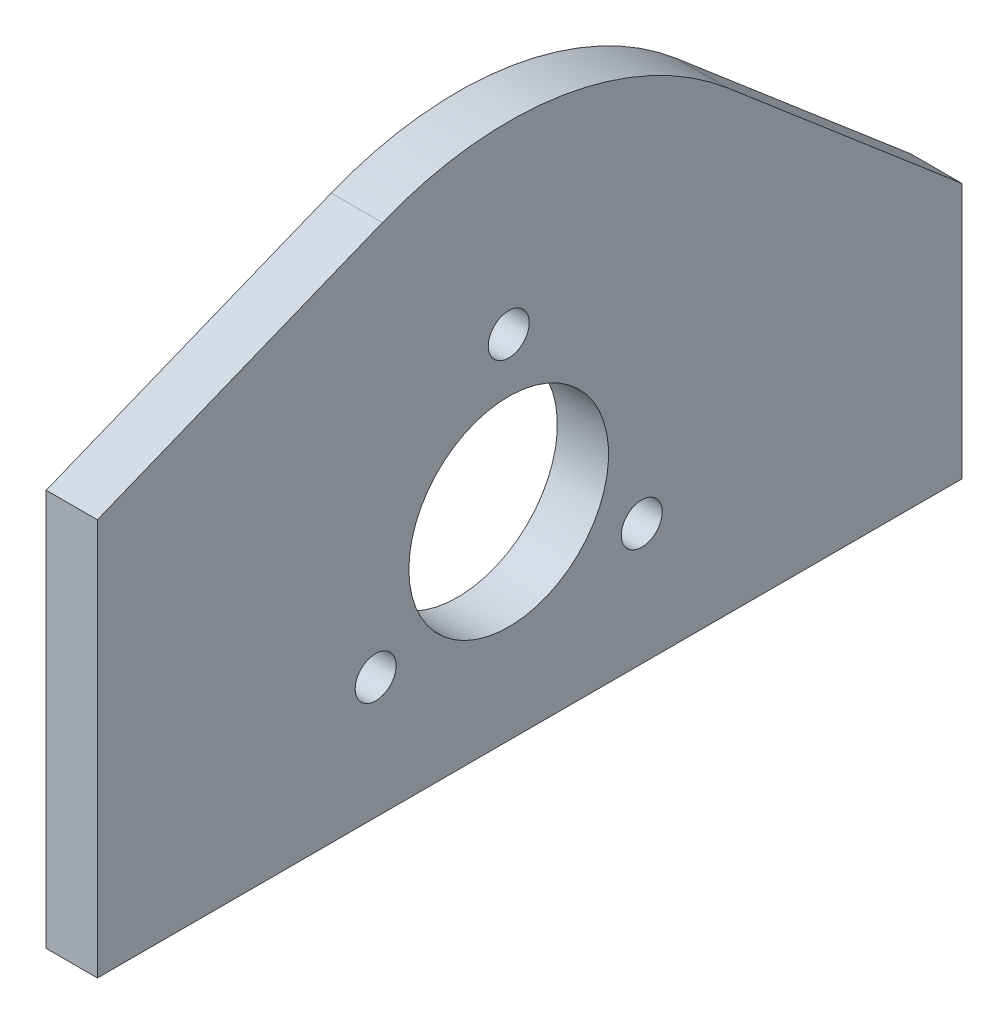
ISO-10303-21;
HEADER;
FILE_DESCRIPTION(('STEP AP214'),'2;1');
FILE_NAME('part.step','',(''),(''),'','','');
FILE_SCHEMA(('AUTOMOTIVE_DESIGN { 1 0 10303 214 1 1 1 1 }'));
ENDSEC;
DATA;
#1=APPLICATION_CONTEXT('core data for automotive mechanical design processes');
#2=APPLICATION_PROTOCOL_DEFINITION('international standard','automotive_design',2000,#1);
#3=PRODUCT_CONTEXT('',#1,'mechanical');
#4=PRODUCT('Part','Part','',(#3));
#5=PRODUCT_RELATED_PRODUCT_CATEGORY('part','',(#4));
#6=PRODUCT_DEFINITION_FORMATION('','',#4);
#7=PRODUCT_DEFINITION_CONTEXT('part definition',#1,'design');
#8=PRODUCT_DEFINITION('design','',#6,#7);
#9=PRODUCT_DEFINITION_SHAPE('','',#8);
#10=(LENGTH_UNIT() NAMED_UNIT(*) SI_UNIT(.MILLI.,.METRE.));
#11=(NAMED_UNIT(*) PLANE_ANGLE_UNIT() SI_UNIT($,.RADIAN.));
#12=(NAMED_UNIT(*) SI_UNIT($,.STERADIAN.) SOLID_ANGLE_UNIT());
#13=UNCERTAINTY_MEASURE_WITH_UNIT(LENGTH_MEASURE(1.E-05),#10,'distance_accuracy_value','');
#14=(GEOMETRIC_REPRESENTATION_CONTEXT(3) GLOBAL_UNCERTAINTY_ASSIGNED_CONTEXT((#13)) GLOBAL_UNIT_ASSIGNED_CONTEXT((#10,
#11,#12)) REPRESENTATION_CONTEXT('',''));
#15=CARTESIAN_POINT('',(0.,0.,0.));
#16=DIRECTION('',(0.,0.,1.));
#17=DIRECTION('',(1.,0.,0.));
#18=AXIS2_PLACEMENT_3D('',#15,#16,#17);
#19=CARTESIAN_POINT('',(5.,81.,0.));
#20=DIRECTION('',(-1.,0.,0.));
#21=DIRECTION('',(0.,0.,-1.));
#22=AXIS2_PLACEMENT_3D('',#19,#20,#21);
#23=CYLINDRICAL_SURFACE('',#22,33.);
#24=CARTESIAN_POINT('',(0.,81.,0.));
#25=DIRECTION('',(-1.,0.,0.));
#26=DIRECTION('',(0.,0.,1.));
#27=AXIS2_PLACEMENT_3D('',#24,#25,#26);
#28=CIRCLE('',#27,33.);
#29=CARTESIAN_POINT('',(0.,111.608123513055,12.3346169380967));
#30=VERTEX_POINT('',#29);
#31=CARTESIAN_POINT('',(0.,106.111358555441,-21.4107372946394));
#32=VERTEX_POINT('',#31);
#33=EDGE_CURVE('E122',#30,#32,#28,.T.);
#34=ORIENTED_EDGE('',*,*,#33,.F.);
#35=DIRECTION('',(-1.,0.,0.));
#36=VECTOR('',#35,1.);
#37=CARTESIAN_POINT('',(5.,111.608123513055,12.3346169380967));
#38=LINE('',#37,#36);
#39=CARTESIAN_POINT('',(5.,111.608123513055,12.3346169380967));
#40=VERTEX_POINT('',#39);
#41=EDGE_CURVE('E121',#40,#30,#38,.T.);
#42=ORIENTED_EDGE('',*,*,#41,.F.);
#43=CARTESIAN_POINT('',(5.,81.,0.));
#44=DIRECTION('',(-1.,0.,0.));
#45=DIRECTION('',(0.,0.,1.));
#46=AXIS2_PLACEMENT_3D('',#43,#44,#45);
#47=CIRCLE('',#46,33.);
#48=CARTESIAN_POINT('',(5.,106.111358555441,-21.4107372946394));
#49=VERTEX_POINT('',#48);
#50=EDGE_CURVE('E135',#40,#49,#47,.T.);
#51=ORIENTED_EDGE('',*,*,#50,.T.);
#52=DIRECTION('',(-1.,0.,0.));
#53=VECTOR('',#52,1.);
#54=CARTESIAN_POINT('',(5.,106.111358555441,-21.4107372946394));
#55=LINE('',#54,#53);
#56=EDGE_CURVE('E11',#49,#32,#55,.T.);
#57=ORIENTED_EDGE('',*,*,#56,.T.);
#58=EDGE_LOOP('',(#34,#42,#51,#57));
#59=FACE_BOUND('',#58,.T.);
#60=ADVANCED_FACE('F39',(#59),#23,.T.);
#61=CARTESIAN_POINT('',(5.,86.6470519239509,-44.2392450723134));
#62=DIRECTION('',(0.,-0.760950259255798,0.64881022104968));
#63=DIRECTION('',(0.,0.64881022104968,0.760950259255798));
#64=AXIS2_PLACEMENT_3D('',#61,#62,#63);
#65=PLANE('',#64);
#66=DIRECTION('',(0.,-0.64881022104968,-0.760950259255798));
#67=VECTOR('',#66,1.);
#68=CARTESIAN_POINT('',(0.,86.6470519239509,-44.2392450723134));
#69=LINE('',#68,#67);
#70=CARTESIAN_POINT('',(0.,86.6470519239509,-44.2392450723134));
#71=VERTEX_POINT('',#70);
#72=EDGE_CURVE('E124',#32,#71,#69,.T.);
#73=ORIENTED_EDGE('',*,*,#72,.F.);
#74=ORIENTED_EDGE('',*,*,#56,.F.);
#75=DIRECTION('',(0.,-0.64881022104968,-0.760950259255798));
#76=VECTOR('',#75,1.);
#77=CARTESIAN_POINT('',(5.,86.6470519239509,-44.2392450723134));
#78=LINE('',#77,#76);
#79=CARTESIAN_POINT('',(5.,86.6470519239509,-44.2392450723134));
#80=VERTEX_POINT('',#79);
#81=EDGE_CURVE('E87',#49,#80,#78,.T.);
#82=ORIENTED_EDGE('',*,*,#81,.T.);
#83=DIRECTION('',(-1.,0.,0.));
#84=VECTOR('',#83,1.);
#85=CARTESIAN_POINT('',(5.,86.6470519239509,-44.2392450723134));
#86=LINE('',#85,#84);
#87=EDGE_CURVE('E47',#80,#71,#86,.T.);
#88=ORIENTED_EDGE('',*,*,#87,.T.);
#89=EDGE_LOOP('',(#73,#74,#82,#88));
#90=FACE_BOUND('',#89,.T.);
#91=ADVANCED_FACE('F141',(#90),#65,.F.);
#92=CARTESIAN_POINT('',(5.,86.6470519239509,-44.2392450723134));
#93=DIRECTION('',(0.,0.,1.));
#94=DIRECTION('',(0.,1.,0.));
#95=AXIS2_PLACEMENT_3D('',#92,#93,#94);
#96=PLANE('',#95);
#97=DIRECTION('',(0.,-1.,0.));
#98=VECTOR('',#97,1.);
#99=CARTESIAN_POINT('',(0.,86.6470519239509,-44.2392450723134));
#100=LINE('',#99,#98);
#101=CARTESIAN_POINT('',(0.,61.6470519239509,-44.2392450723133));
#102=VERTEX_POINT('',#101);
#103=EDGE_CURVE('E128',#71,#102,#100,.T.);
#104=ORIENTED_EDGE('',*,*,#103,.F.);
#105=ORIENTED_EDGE('',*,*,#87,.F.);
#106=DIRECTION('',(0.,-1.,0.));
#107=VECTOR('',#106,1.);
#108=CARTESIAN_POINT('',(5.,86.6470519239509,-44.2392450723134));
#109=LINE('',#108,#107);
#110=CARTESIAN_POINT('',(5.,61.6470519239509,-44.2392450723133));
#111=VERTEX_POINT('',#110);
#112=EDGE_CURVE('E115',#80,#111,#109,.T.);
#113=ORIENTED_EDGE('',*,*,#112,.T.);
#114=DIRECTION('',(-1.,0.,0.));
#115=VECTOR('',#114,1.);
#116=CARTESIAN_POINT('',(5.,61.6470519239509,-44.2392450723133));
#117=LINE('',#116,#115);
#118=EDGE_CURVE('E109',#111,#102,#117,.T.);
#119=ORIENTED_EDGE('',*,*,#118,.T.);
#120=EDGE_LOOP('',(#104,#105,#113,#119));
#121=FACE_BOUND('',#120,.T.);
#122=ADVANCED_FACE('F208',(#121),#96,.F.);
#123=CARTESIAN_POINT('',(5.,61.6470519239509,-44.2392450723133));
#124=DIRECTION('',(0.,1.,0.));
#125=DIRECTION('',(0.,0.,-1.));
#126=AXIS2_PLACEMENT_3D('',#123,#124,#125);
#127=PLANE('',#126);
#128=DIRECTION('',(0.,0.,1.));
#129=VECTOR('',#128,1.);
#130=CARTESIAN_POINT('',(0.,61.6470519239509,-44.2392450723133));
#131=LINE('',#130,#129);
#132=CARTESIAN_POINT('',(0.,61.6470519239509,40.1601837681464));
#133=VERTEX_POINT('',#132);
#134=EDGE_CURVE('E131',#102,#133,#131,.T.);
#135=ORIENTED_EDGE('',*,*,#134,.F.);
#136=ORIENTED_EDGE('',*,*,#118,.F.);
#137=DIRECTION('',(0.,0.,1.));
#138=VECTOR('',#137,1.);
#139=CARTESIAN_POINT('',(5.,61.6470519239509,-44.2392450723133));
#140=LINE('',#139,#138);
#141=CARTESIAN_POINT('',(5.,61.6470519239509,40.1601837681464));
#142=VERTEX_POINT('',#141);
#143=EDGE_CURVE('E99',#111,#142,#140,.T.);
#144=ORIENTED_EDGE('',*,*,#143,.T.);
#145=DIRECTION('',(-1.,0.,0.));
#146=VECTOR('',#145,1.);
#147=CARTESIAN_POINT('',(5.,61.6470519239509,40.1601837681464));
#148=LINE('',#147,#146);
#149=EDGE_CURVE('E104',#142,#133,#148,.T.);
#150=ORIENTED_EDGE('',*,*,#149,.T.);
#151=EDGE_LOOP('',(#135,#136,#144,#150));
#152=FACE_BOUND('',#151,.T.);
#153=ADVANCED_FACE('F112',(#152),#127,.F.);
#154=CARTESIAN_POINT('',(5.,61.6470519239509,40.1601837681464));
#155=DIRECTION('',(0.,0.,-1.));
#156=DIRECTION('',(1.,0.,0.));
#157=AXIS2_PLACEMENT_3D('',#154,#155,#156);
#158=PLANE('',#157);
#159=DIRECTION('',(0.,1.,0.));
#160=VECTOR('',#159,1.);
#161=CARTESIAN_POINT('',(0.,61.6470519239509,40.1601837681464));
#162=LINE('',#161,#160);
#163=CARTESIAN_POINT('',(0.,100.394835387512,40.1601837681464));
#164=VERTEX_POINT('',#163);
#165=EDGE_CURVE('E106',#133,#164,#162,.T.);
#166=ORIENTED_EDGE('',*,*,#165,.F.);
#167=ORIENTED_EDGE('',*,*,#149,.F.);
#168=DIRECTION('',(0.,1.,0.));
#169=VECTOR('',#168,1.);
#170=CARTESIAN_POINT('',(5.,61.6470519239509,40.1601837681464));
#171=LINE('',#170,#169);
#172=CARTESIAN_POINT('',(5.,100.394835387512,40.1601837681464));
#173=VERTEX_POINT('',#172);
#174=EDGE_CURVE('E95',#142,#173,#171,.T.);
#175=ORIENTED_EDGE('',*,*,#174,.T.);
#176=DIRECTION('',(-1.,0.,0.));
#177=VECTOR('',#176,1.);
#178=CARTESIAN_POINT('',(5.,100.394835387512,40.1601837681464));
#179=LINE('',#178,#177);
#180=EDGE_CURVE('E110',#173,#164,#179,.T.);
#181=ORIENTED_EDGE('',*,*,#180,.T.);
#182=EDGE_LOOP('',(#166,#167,#175,#181));
#183=FACE_BOUND('',#182,.T.);
#184=ADVANCED_FACE('F105',(#183),#158,.F.);
#185=CARTESIAN_POINT('',(5.,100.394835387512,40.1601837681464));
#186=DIRECTION('',(0.,-0.927518894334992,-0.37377627085142));
#187=DIRECTION('',(0.,-0.37377627085142,0.927518894334992));
#188=AXIS2_PLACEMENT_3D('',#185,#186,#187);
#189=PLANE('',#188);
#190=DIRECTION('',(0.,0.37377627085142,-0.927518894334992));
#191=VECTOR('',#190,1.);
#192=CARTESIAN_POINT('',(0.,100.394835387512,40.1601837681464));
#193=LINE('',#192,#191);
#194=EDGE_CURVE('E75',#164,#30,#193,.T.);
#195=ORIENTED_EDGE('',*,*,#194,.F.);
#196=ORIENTED_EDGE('',*,*,#180,.F.);
#197=DIRECTION('',(0.,0.37377627085142,-0.927518894334992));
#198=VECTOR('',#197,1.);
#199=CARTESIAN_POINT('',(5.,100.394835387512,40.1601837681464));
#200=LINE('',#199,#198);
#201=EDGE_CURVE('E55',#173,#40,#200,.T.);
#202=ORIENTED_EDGE('',*,*,#201,.T.);
#203=ORIENTED_EDGE('',*,*,#41,.T.);
#204=EDGE_LOOP('',(#195,#196,#202,#203));
#205=FACE_BOUND('',#204,.T.);
#206=ADVANCED_FACE('F218',(#205),#189,.F.);
#207=CARTESIAN_POINT('',(5.,81.,0.));
#208=DIRECTION('',(1.,0.,0.));
#209=DIRECTION('',(0.,0.,1.));
#210=AXIS2_PLACEMENT_3D('',#207,#208,#209);
#211=PLANE('',#210);
#212=CARTESIAN_POINT('',(5.,81.,0.));
#213=DIRECTION('',(-1.,0.,0.));
#214=DIRECTION('',(0.,0.,1.));
#215=AXIS2_PLACEMENT_3D('',#212,#213,#214);
#216=CIRCLE('',#215,9.75000000000001);
#217=CARTESIAN_POINT('',(5.,81.,9.75000000000001));
#218=VERTEX_POINT('',#217);
#219=EDGE_CURVE('E165',#218,#218,#216,.T.);
#220=ORIENTED_EDGE('',*,*,#219,.T.);
#221=EDGE_LOOP('',(#220));
#222=FACE_BOUND('',#221,.T.);
#223=CARTESIAN_POINT('',(5.,96.,0.));
#224=DIRECTION('',(-1.,0.,0.));
#225=DIRECTION('',(0.,0.,1.));
#226=AXIS2_PLACEMENT_3D('',#223,#224,#225);
#227=CIRCLE('',#226,2.);
#228=CARTESIAN_POINT('',(5.,96.,2.));
#229=VERTEX_POINT('',#228);
#230=EDGE_CURVE('E159',#229,#229,#227,.T.);
#231=ORIENTED_EDGE('',*,*,#230,.T.);
#232=EDGE_LOOP('',(#231));
#233=FACE_BOUND('',#232,.T.);
#234=CARTESIAN_POINT('',(5.,73.4999999999999,-12.9903810567665));
#235=DIRECTION('',(-1.,0.,0.));
#236=DIRECTION('',(0.,0.,1.));
#237=AXIS2_PLACEMENT_3D('',#234,#235,#236);
#238=CIRCLE('',#237,2.);
#239=CARTESIAN_POINT('',(5.,73.4999999999999,-10.9903810567665));
#240=VERTEX_POINT('',#239);
#241=EDGE_CURVE('E153',#240,#240,#238,.T.);
#242=ORIENTED_EDGE('',*,*,#241,.T.);
#243=EDGE_LOOP('',(#242));
#244=FACE_BOUND('',#243,.T.);
#245=CARTESIAN_POINT('',(5.,73.5000000000001,12.9903810567667));
#246=DIRECTION('',(-1.,0.,0.));
#247=DIRECTION('',(0.,0.,1.));
#248=AXIS2_PLACEMENT_3D('',#245,#246,#247);
#249=CIRCLE('',#248,2.00000000000001);
#250=CARTESIAN_POINT('',(5.,73.5000000000001,14.9903810567667));
#251=VERTEX_POINT('',#250);
#252=EDGE_CURVE('E125',#251,#251,#249,.T.);
#253=ORIENTED_EDGE('',*,*,#252,.T.);
#254=EDGE_LOOP('',(#253));
#255=FACE_BOUND('',#254,.T.);
#256=ORIENTED_EDGE('',*,*,#50,.F.);
#257=ORIENTED_EDGE('',*,*,#201,.F.);
#258=ORIENTED_EDGE('',*,*,#174,.F.);
#259=ORIENTED_EDGE('',*,*,#143,.F.);
#260=ORIENTED_EDGE('',*,*,#112,.F.);
#261=ORIENTED_EDGE('',*,*,#81,.F.);
#262=EDGE_LOOP('',(#256,#257,#258,#259,#260,#261));
#263=FACE_BOUND('',#262,.T.);
#264=ADVANCED_FACE('F97',(#222,#233,#244,#255,#263),#211,.T.);
#265=CARTESIAN_POINT('',(0.,81.,0.));
#266=DIRECTION('',(1.,0.,0.));
#267=DIRECTION('',(0.,0.,1.));
#268=AXIS2_PLACEMENT_3D('',#265,#266,#267);
#269=PLANE('',#268);
#270=CARTESIAN_POINT('',(0.,81.,0.));
#271=DIRECTION('',(-1.,0.,0.));
#272=DIRECTION('',(0.,0.,1.));
#273=AXIS2_PLACEMENT_3D('',#270,#271,#272);
#274=CIRCLE('',#273,9.75000000000001);
#275=CARTESIAN_POINT('',(0.,81.,9.75000000000001));
#276=VERTEX_POINT('',#275);
#277=EDGE_CURVE('E168',#276,#276,#274,.T.);
#278=ORIENTED_EDGE('',*,*,#277,.F.);
#279=EDGE_LOOP('',(#278));
#280=FACE_BOUND('',#279,.T.);
#281=CARTESIAN_POINT('',(0.,96.,0.));
#282=DIRECTION('',(-1.,0.,0.));
#283=DIRECTION('',(0.,0.,1.));
#284=AXIS2_PLACEMENT_3D('',#281,#282,#283);
#285=CIRCLE('',#284,2.);
#286=CARTESIAN_POINT('',(0.,96.,2.));
#287=VERTEX_POINT('',#286);
#288=EDGE_CURVE('E162',#287,#287,#285,.T.);
#289=ORIENTED_EDGE('',*,*,#288,.F.);
#290=EDGE_LOOP('',(#289));
#291=FACE_BOUND('',#290,.T.);
#292=CARTESIAN_POINT('',(0.,73.4999999999999,-12.9903810567665));
#293=DIRECTION('',(-1.,0.,0.));
#294=DIRECTION('',(0.,0.,1.));
#295=AXIS2_PLACEMENT_3D('',#292,#293,#294);
#296=CIRCLE('',#295,2.);
#297=CARTESIAN_POINT('',(0.,73.4999999999999,-10.9903810567665));
#298=VERTEX_POINT('',#297);
#299=EDGE_CURVE('E156',#298,#298,#296,.T.);
#300=ORIENTED_EDGE('',*,*,#299,.F.);
#301=EDGE_LOOP('',(#300));
#302=FACE_BOUND('',#301,.T.);
#303=CARTESIAN_POINT('',(0.,73.5000000000001,12.9903810567667));
#304=DIRECTION('',(-1.,0.,0.));
#305=DIRECTION('',(0.,0.,1.));
#306=AXIS2_PLACEMENT_3D('',#303,#304,#305);
#307=CIRCLE('',#306,2.00000000000001);
#308=CARTESIAN_POINT('',(0.,73.5000000000001,14.9903810567667));
#309=VERTEX_POINT('',#308);
#310=EDGE_CURVE('E150',#309,#309,#307,.T.);
#311=ORIENTED_EDGE('',*,*,#310,.F.);
#312=EDGE_LOOP('',(#311));
#313=FACE_BOUND('',#312,.T.);
#314=ORIENTED_EDGE('',*,*,#33,.T.);
#315=ORIENTED_EDGE('',*,*,#72,.T.);
#316=ORIENTED_EDGE('',*,*,#103,.T.);
#317=ORIENTED_EDGE('',*,*,#134,.T.);
#318=ORIENTED_EDGE('',*,*,#165,.T.);
#319=ORIENTED_EDGE('',*,*,#194,.T.);
#320=EDGE_LOOP('',(#314,#315,#316,#317,#318,#319));
#321=FACE_BOUND('',#320,.T.);
#322=ADVANCED_FACE('F143',(#280,#291,#302,#313,#321),#269,.F.);
#323=CARTESIAN_POINT('',(5.,73.5000000000001,12.9903810567667));
#324=DIRECTION('',(-1.,0.,0.));
#325=DIRECTION('',(0.,0.,-1.));
#326=AXIS2_PLACEMENT_3D('',#323,#324,#325);
#327=CYLINDRICAL_SURFACE('',#326,2.00000000000001);
#328=ORIENTED_EDGE('',*,*,#252,.F.);
#329=EDGE_LOOP('',(#328));
#330=FACE_BOUND('',#329,.T.);
#331=ORIENTED_EDGE('',*,*,#310,.T.);
#332=EDGE_LOOP('',(#331));
#333=FACE_BOUND('',#332,.T.);
#334=ADVANCED_FACE('F185',(#330,#333),#327,.F.);
#335=CARTESIAN_POINT('',(5.,73.4999999999999,-12.9903810567665));
#336=DIRECTION('',(-1.,0.,0.));
#337=DIRECTION('',(0.,0.,-1.));
#338=AXIS2_PLACEMENT_3D('',#335,#336,#337);
#339=CYLINDRICAL_SURFACE('',#338,2.);
#340=ORIENTED_EDGE('',*,*,#241,.F.);
#341=EDGE_LOOP('',(#340));
#342=FACE_BOUND('',#341,.T.);
#343=ORIENTED_EDGE('',*,*,#299,.T.);
#344=EDGE_LOOP('',(#343));
#345=FACE_BOUND('',#344,.T.);
#346=ADVANCED_FACE('F194',(#342,#345),#339,.F.);
#347=CARTESIAN_POINT('',(5.,96.,0.));
#348=DIRECTION('',(-1.,0.,0.));
#349=DIRECTION('',(0.,0.,-1.));
#350=AXIS2_PLACEMENT_3D('',#347,#348,#349);
#351=CYLINDRICAL_SURFACE('',#350,2.);
#352=ORIENTED_EDGE('',*,*,#230,.F.);
#353=EDGE_LOOP('',(#352));
#354=FACE_BOUND('',#353,.T.);
#355=ORIENTED_EDGE('',*,*,#288,.T.);
#356=EDGE_LOOP('',(#355));
#357=FACE_BOUND('',#356,.T.);
#358=ADVANCED_FACE('F179',(#354,#357),#351,.F.);
#359=CARTESIAN_POINT('',(5.,81.,0.));
#360=DIRECTION('',(-1.,0.,0.));
#361=DIRECTION('',(0.,0.,-1.));
#362=AXIS2_PLACEMENT_3D('',#359,#360,#361);
#363=CYLINDRICAL_SURFACE('',#362,9.75000000000001);
#364=ORIENTED_EDGE('',*,*,#219,.F.);
#365=EDGE_LOOP('',(#364));
#366=FACE_BOUND('',#365,.T.);
#367=ORIENTED_EDGE('',*,*,#277,.T.);
#368=EDGE_LOOP('',(#367));
#369=FACE_BOUND('',#368,.T.);
#370=ADVANCED_FACE('F176',(#366,#369),#363,.F.);
#371=CLOSED_SHELL('',(#60,#91,#122,#153,#184,#206,#264,#322,#334,#346,#358,#370));
#372=MANIFOLD_SOLID_BREP('B2',#371);
#373=ADVANCED_BREP_SHAPE_REPRESENTATION('',(#18,#372),#14);
#374=SHAPE_DEFINITION_REPRESENTATION(#9,#373);
ENDSEC;
END-ISO-10303-21;
